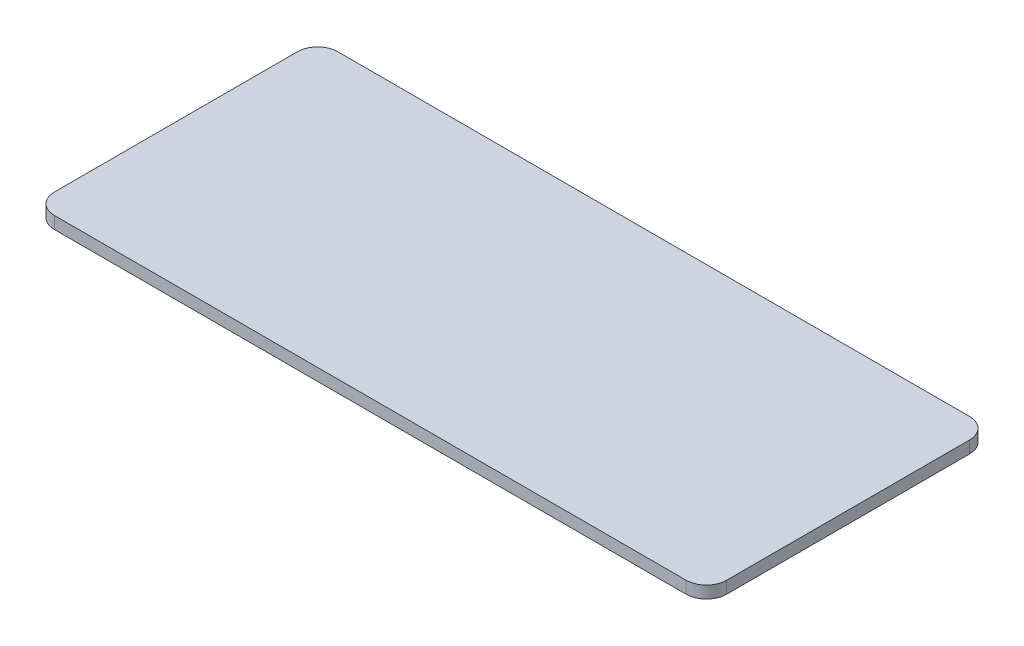
ISO-10303-21;
HEADER;
FILE_DESCRIPTION(('STEP AP214'),'2;1');
FILE_NAME('part.step','',(''),(''),'','','');
FILE_SCHEMA(('AUTOMOTIVE_DESIGN { 1 0 10303 214 1 1 1 1 }'));
ENDSEC;
DATA;
#1=APPLICATION_CONTEXT('core data for automotive mechanical design processes');
#2=APPLICATION_PROTOCOL_DEFINITION('international standard','automotive_design',2000,#1);
#3=PRODUCT_CONTEXT('',#1,'mechanical');
#4=PRODUCT('Part','Part','',(#3));
#5=PRODUCT_RELATED_PRODUCT_CATEGORY('part','',(#4));
#6=PRODUCT_DEFINITION_FORMATION('','',#4);
#7=PRODUCT_DEFINITION_CONTEXT('part definition',#1,'design');
#8=PRODUCT_DEFINITION('design','',#6,#7);
#9=PRODUCT_DEFINITION_SHAPE('','',#8);
#10=(LENGTH_UNIT() NAMED_UNIT(*) SI_UNIT(.MILLI.,.METRE.));
#11=(NAMED_UNIT(*) PLANE_ANGLE_UNIT() SI_UNIT($,.RADIAN.));
#12=(NAMED_UNIT(*) SI_UNIT($,.STERADIAN.) SOLID_ANGLE_UNIT());
#13=UNCERTAINTY_MEASURE_WITH_UNIT(LENGTH_MEASURE(1.E-05),#10,'distance_accuracy_value','');
#14=(GEOMETRIC_REPRESENTATION_CONTEXT(3) GLOBAL_UNCERTAINTY_ASSIGNED_CONTEXT((#13)) GLOBAL_UNIT_ASSIGNED_CONTEXT((#10,
#11,#12)) REPRESENTATION_CONTEXT('',''));
#15=CARTESIAN_POINT('',(0.,0.,0.));
#16=DIRECTION('',(0.,0.,1.));
#17=DIRECTION('',(1.,0.,0.));
#18=AXIS2_PLACEMENT_3D('',#15,#16,#17);
#19=CARTESIAN_POINT('',(0.,47.,0.));
#20=DIRECTION('',(0.,1.,0.));
#21=DIRECTION('',(0.,0.,1.));
#22=AXIS2_PLACEMENT_3D('',#19,#20,#21);
#23=PLANE('',#22);
#24=CARTESIAN_POINT('',(62.6371308016877,47.,-42.8481012658228));
#25=DIRECTION('',(0.,1.,0.));
#26=DIRECTION('',(0.,0.,1.));
#27=AXIS2_PLACEMENT_3D('',#24,#25,#26);
#28=CIRCLE('',#27,5.);
#29=CARTESIAN_POINT('',(62.6371308016877,47.,-47.8481012658228));
#30=VERTEX_POINT('',#29);
#31=CARTESIAN_POINT('',(67.6371308016878,47.,-42.8481012658228));
#32=VERTEX_POINT('',#31);
#33=EDGE_CURVE('E127',#30,#32,#28,.F.);
#34=ORIENTED_EDGE('',*,*,#33,.T.);
#35=DIRECTION('',(0.,0.,-1.));
#36=VECTOR('',#35,1.);
#37=CARTESIAN_POINT('',(67.6371308016878,47.,-47.8481012658228));
#38=LINE('',#37,#36);
#39=CARTESIAN_POINT('',(67.6371308016878,47.,17.1518987341772));
#40=VERTEX_POINT('',#39);
#41=EDGE_CURVE('E130',#40,#32,#38,.T.);
#42=ORIENTED_EDGE('',*,*,#41,.F.);
#43=CARTESIAN_POINT('',(62.6371308016878,47.,17.1518987341772));
#44=DIRECTION('',(0.,1.,0.));
#45=DIRECTION('',(0.,0.,1.));
#46=AXIS2_PLACEMENT_3D('',#43,#44,#45);
#47=CIRCLE('',#46,5.);
#48=CARTESIAN_POINT('',(62.6371308016878,47.,22.1518987341772));
#49=VERTEX_POINT('',#48);
#50=EDGE_CURVE('E115',#40,#49,#47,.F.);
#51=ORIENTED_EDGE('',*,*,#50,.T.);
#52=DIRECTION('',(1.,0.,0.));
#53=VECTOR('',#52,1.);
#54=CARTESIAN_POINT('',(-98.3544303797468,47.,22.1518987341772));
#55=LINE('',#54,#53);
#56=CARTESIAN_POINT('',(-93.3544303797468,47.,22.1518987341772));
#57=VERTEX_POINT('',#56);
#58=EDGE_CURVE('E106',#57,#49,#55,.T.);
#59=ORIENTED_EDGE('',*,*,#58,.F.);
#60=CARTESIAN_POINT('',(-93.3544303797468,47.,17.1518987341772));
#61=DIRECTION('',(0.,1.,0.));
#62=DIRECTION('',(0.,0.,1.));
#63=AXIS2_PLACEMENT_3D('',#60,#61,#62);
#64=CIRCLE('',#63,5.);
#65=CARTESIAN_POINT('',(-98.3544303797468,47.,17.1518987341772));
#66=VERTEX_POINT('',#65);
#67=EDGE_CURVE('E37',#57,#66,#64,.F.);
#68=ORIENTED_EDGE('',*,*,#67,.T.);
#69=DIRECTION('',(0.,0.,1.));
#70=VECTOR('',#69,1.);
#71=CARTESIAN_POINT('',(-98.3544303797468,47.,-47.8481012658228));
#72=LINE('',#71,#70);
#73=CARTESIAN_POINT('',(-98.3544303797468,47.,-42.8481012658228));
#74=VERTEX_POINT('',#73);
#75=EDGE_CURVE('E99',#74,#66,#72,.T.);
#76=ORIENTED_EDGE('',*,*,#75,.F.);
#77=CARTESIAN_POINT('',(-93.3544303797468,47.,-42.8481012658228));
#78=DIRECTION('',(0.,1.,0.));
#79=DIRECTION('',(0.,0.,1.));
#80=AXIS2_PLACEMENT_3D('',#77,#78,#79);
#81=CIRCLE('',#80,5.);
#82=CARTESIAN_POINT('',(-93.3544303797468,47.,-47.8481012658228));
#83=VERTEX_POINT('',#82);
#84=EDGE_CURVE('E107',#74,#83,#81,.F.);
#85=ORIENTED_EDGE('',*,*,#84,.T.);
#86=DIRECTION('',(-1.,0.,0.));
#87=VECTOR('',#86,1.);
#88=CARTESIAN_POINT('',(-98.3544303797468,47.,-47.8481012658228));
#89=LINE('',#88,#87);
#90=EDGE_CURVE('E142',#30,#83,#89,.T.);
#91=ORIENTED_EDGE('',*,*,#90,.F.);
#92=EDGE_LOOP('',(#34,#42,#51,#59,#68,#76,#85,#91));
#93=FACE_BOUND('',#92,.T.);
#94=ADVANCED_FACE('F33',(#93),#23,.F.);
#95=CARTESIAN_POINT('',(-98.3544303797468,50.,-47.8481012658228));
#96=DIRECTION('',(1.,0.,0.));
#97=DIRECTION('',(0.,0.,-1.));
#98=AXIS2_PLACEMENT_3D('',#95,#96,#97);
#99=PLANE('',#98);
#100=DIRECTION('',(0.,-1.,0.));
#101=VECTOR('',#100,1.);
#102=CARTESIAN_POINT('',(-98.3544303797468,50.,-42.8481012658228));
#103=LINE('',#102,#101);
#104=CARTESIAN_POINT('',(-98.3544303797468,50.,-42.8481012658228));
#105=VERTEX_POINT('',#104);
#106=EDGE_CURVE('E103',#105,#74,#103,.T.);
#107=ORIENTED_EDGE('',*,*,#106,.T.);
#108=ORIENTED_EDGE('',*,*,#75,.T.);
#109=DIRECTION('',(0.,-1.,0.));
#110=VECTOR('',#109,1.);
#111=CARTESIAN_POINT('',(-98.3544303797468,50.,17.1518987341772));
#112=LINE('',#111,#110);
#113=CARTESIAN_POINT('',(-98.3544303797468,50.,17.1518987341772));
#114=VERTEX_POINT('',#113);
#115=EDGE_CURVE('E56',#66,#114,#112,.F.);
#116=ORIENTED_EDGE('',*,*,#115,.T.);
#117=DIRECTION('',(0.,0.,1.));
#118=VECTOR('',#117,1.);
#119=CARTESIAN_POINT('',(-98.3544303797468,50.,-47.8481012658228));
#120=LINE('',#119,#118);
#121=EDGE_CURVE('E11',#105,#114,#120,.T.);
#122=ORIENTED_EDGE('',*,*,#121,.F.);
#123=EDGE_LOOP('',(#107,#108,#116,#122));
#124=FACE_BOUND('',#123,.T.);
#125=ADVANCED_FACE('F101',(#124),#99,.F.);
#126=CARTESIAN_POINT('',(-98.3544303797468,50.,22.1518987341772));
#127=DIRECTION('',(0.,0.,-1.));
#128=DIRECTION('',(-1.,0.,0.));
#129=AXIS2_PLACEMENT_3D('',#126,#127,#128);
#130=PLANE('',#129);
#131=DIRECTION('',(0.,-1.,0.));
#132=VECTOR('',#131,1.);
#133=CARTESIAN_POINT('',(-93.3544303797468,50.,22.1518987341772));
#134=LINE('',#133,#132);
#135=CARTESIAN_POINT('',(-93.3544303797468,50.,22.1518987341772));
#136=VERTEX_POINT('',#135);
#137=EDGE_CURVE('E141',#136,#57,#134,.T.);
#138=ORIENTED_EDGE('',*,*,#137,.T.);
#139=ORIENTED_EDGE('',*,*,#58,.T.);
#140=DIRECTION('',(0.,-1.,0.));
#141=VECTOR('',#140,1.);
#142=CARTESIAN_POINT('',(62.6371308016878,50.,22.1518987341772));
#143=LINE('',#142,#141);
#144=CARTESIAN_POINT('',(62.6371308016878,50.,22.1518987341772));
#145=VERTEX_POINT('',#144);
#146=EDGE_CURVE('E135',#49,#145,#143,.F.);
#147=ORIENTED_EDGE('',*,*,#146,.T.);
#148=DIRECTION('',(1.,0.,0.));
#149=VECTOR('',#148,1.);
#150=CARTESIAN_POINT('',(-98.3544303797468,50.,22.1518987341772));
#151=LINE('',#150,#149);
#152=EDGE_CURVE('E42',#136,#145,#151,.T.);
#153=ORIENTED_EDGE('',*,*,#152,.F.);
#154=EDGE_LOOP('',(#138,#139,#147,#153));
#155=FACE_BOUND('',#154,.T.);
#156=ADVANCED_FACE('F176',(#155),#130,.F.);
#157=CARTESIAN_POINT('',(67.6371308016878,50.,-47.8481012658228));
#158=DIRECTION('',(-1.,0.,0.));
#159=DIRECTION('',(0.,0.,1.));
#160=AXIS2_PLACEMENT_3D('',#157,#158,#159);
#161=PLANE('',#160);
#162=DIRECTION('',(0.,-1.,0.));
#163=VECTOR('',#162,1.);
#164=CARTESIAN_POINT('',(67.6371308016878,50.,17.1518987341772));
#165=LINE('',#164,#163);
#166=CARTESIAN_POINT('',(67.6371308016878,50.,17.1518987341772));
#167=VERTEX_POINT('',#166);
#168=EDGE_CURVE('E150',#167,#40,#165,.T.);
#169=ORIENTED_EDGE('',*,*,#168,.T.);
#170=ORIENTED_EDGE('',*,*,#41,.T.);
#171=DIRECTION('',(0.,-1.,0.));
#172=VECTOR('',#171,1.);
#173=CARTESIAN_POINT('',(67.6371308016878,50.,-42.8481012658228));
#174=LINE('',#173,#172);
#175=CARTESIAN_POINT('',(67.6371308016878,50.,-42.8481012658228));
#176=VERTEX_POINT('',#175);
#177=EDGE_CURVE('E144',#32,#176,#174,.F.);
#178=ORIENTED_EDGE('',*,*,#177,.T.);
#179=DIRECTION('',(0.,0.,-1.));
#180=VECTOR('',#179,1.);
#181=CARTESIAN_POINT('',(67.6371308016878,50.,-47.8481012658228));
#182=LINE('',#181,#180);
#183=EDGE_CURVE('E120',#167,#176,#182,.T.);
#184=ORIENTED_EDGE('',*,*,#183,.F.);
#185=EDGE_LOOP('',(#169,#170,#178,#184));
#186=FACE_BOUND('',#185,.T.);
#187=ADVANCED_FACE('F179',(#186),#161,.F.);
#188=CARTESIAN_POINT('',(-98.3544303797468,50.,-47.8481012658228));
#189=DIRECTION('',(0.,0.,1.));
#190=DIRECTION('',(1.,0.,0.));
#191=AXIS2_PLACEMENT_3D('',#188,#189,#190);
#192=PLANE('',#191);
#193=DIRECTION('',(0.,-1.,0.));
#194=VECTOR('',#193,1.);
#195=CARTESIAN_POINT('',(62.6371308016877,50.,-47.8481012658228));
#196=LINE('',#195,#194);
#197=CARTESIAN_POINT('',(62.6371308016877,50.,-47.8481012658228));
#198=VERTEX_POINT('',#197);
#199=EDGE_CURVE('E122',#198,#30,#196,.T.);
#200=ORIENTED_EDGE('',*,*,#199,.T.);
#201=ORIENTED_EDGE('',*,*,#90,.T.);
#202=DIRECTION('',(0.,-1.,0.));
#203=VECTOR('',#202,1.);
#204=CARTESIAN_POINT('',(-93.3544303797468,50.,-47.8481012658228));
#205=LINE('',#204,#203);
#206=CARTESIAN_POINT('',(-93.3544303797468,50.,-47.8481012658228));
#207=VERTEX_POINT('',#206);
#208=EDGE_CURVE('E152',#83,#207,#205,.F.);
#209=ORIENTED_EDGE('',*,*,#208,.T.);
#210=DIRECTION('',(-1.,0.,0.));
#211=VECTOR('',#210,1.);
#212=CARTESIAN_POINT('',(-98.3544303797468,50.,-47.8481012658228));
#213=LINE('',#212,#211);
#214=EDGE_CURVE('E118',#198,#207,#213,.T.);
#215=ORIENTED_EDGE('',*,*,#214,.F.);
#216=EDGE_LOOP('',(#200,#201,#209,#215));
#217=FACE_BOUND('',#216,.T.);
#218=ADVANCED_FACE('F157',(#217),#192,.F.);
#219=CARTESIAN_POINT('',(-93.3544303797468,50.,-42.8481012658228));
#220=DIRECTION('',(0.,-1.,0.));
#221=DIRECTION('',(0.,0.,-1.));
#222=AXIS2_PLACEMENT_3D('',#219,#220,#221);
#223=CYLINDRICAL_SURFACE('',#222,5.);
#224=ORIENTED_EDGE('',*,*,#84,.F.);
#225=ORIENTED_EDGE('',*,*,#106,.F.);
#226=CARTESIAN_POINT('',(-93.3544303797468,50.,-42.8481012658228));
#227=DIRECTION('',(0.,1.,0.));
#228=DIRECTION('',(0.,0.,1.));
#229=AXIS2_PLACEMENT_3D('',#226,#227,#228);
#230=CIRCLE('',#229,5.);
#231=EDGE_CURVE('E49',#207,#105,#230,.T.);
#232=ORIENTED_EDGE('',*,*,#231,.F.);
#233=ORIENTED_EDGE('',*,*,#208,.F.);
#234=EDGE_LOOP('',(#224,#225,#232,#233));
#235=FACE_BOUND('',#234,.T.);
#236=ADVANCED_FACE('F166',(#235),#223,.T.);
#237=CARTESIAN_POINT('',(62.6371308016877,50.,-42.8481012658228));
#238=DIRECTION('',(0.,-1.,0.));
#239=DIRECTION('',(0.,0.,-1.));
#240=AXIS2_PLACEMENT_3D('',#237,#238,#239);
#241=CYLINDRICAL_SURFACE('',#240,5.);
#242=ORIENTED_EDGE('',*,*,#33,.F.);
#243=ORIENTED_EDGE('',*,*,#199,.F.);
#244=CARTESIAN_POINT('',(62.6371308016877,50.,-42.8481012658228));
#245=DIRECTION('',(0.,1.,0.));
#246=DIRECTION('',(0.,0.,1.));
#247=AXIS2_PLACEMENT_3D('',#244,#245,#246);
#248=CIRCLE('',#247,5.);
#249=EDGE_CURVE('E163',#176,#198,#248,.T.);
#250=ORIENTED_EDGE('',*,*,#249,.F.);
#251=ORIENTED_EDGE('',*,*,#177,.F.);
#252=EDGE_LOOP('',(#242,#243,#250,#251));
#253=FACE_BOUND('',#252,.T.);
#254=ADVANCED_FACE('F161',(#253),#241,.T.);
#255=CARTESIAN_POINT('',(62.6371308016878,50.,17.1518987341772));
#256=DIRECTION('',(0.,-1.,0.));
#257=DIRECTION('',(0.,0.,-1.));
#258=AXIS2_PLACEMENT_3D('',#255,#256,#257);
#259=CYLINDRICAL_SURFACE('',#258,5.);
#260=ORIENTED_EDGE('',*,*,#50,.F.);
#261=ORIENTED_EDGE('',*,*,#168,.F.);
#262=CARTESIAN_POINT('',(62.6371308016878,50.,17.1518987341772));
#263=DIRECTION('',(0.,1.,0.));
#264=DIRECTION('',(0.,0.,1.));
#265=AXIS2_PLACEMENT_3D('',#262,#263,#264);
#266=CIRCLE('',#265,5.);
#267=EDGE_CURVE('E137',#145,#167,#266,.T.);
#268=ORIENTED_EDGE('',*,*,#267,.F.);
#269=ORIENTED_EDGE('',*,*,#146,.F.);
#270=EDGE_LOOP('',(#260,#261,#268,#269));
#271=FACE_BOUND('',#270,.T.);
#272=ADVANCED_FACE('F136',(#271),#259,.T.);
#273=CARTESIAN_POINT('',(-93.3544303797468,50.,17.1518987341772));
#274=DIRECTION('',(0.,-1.,0.));
#275=DIRECTION('',(0.,0.,-1.));
#276=AXIS2_PLACEMENT_3D('',#273,#274,#275);
#277=CYLINDRICAL_SURFACE('',#276,5.);
#278=ORIENTED_EDGE('',*,*,#67,.F.);
#279=ORIENTED_EDGE('',*,*,#137,.F.);
#280=CARTESIAN_POINT('',(-93.3544303797468,50.,17.1518987341772));
#281=DIRECTION('',(0.,1.,0.));
#282=DIRECTION('',(0.,0.,1.));
#283=AXIS2_PLACEMENT_3D('',#280,#281,#282);
#284=CIRCLE('',#283,5.);
#285=EDGE_CURVE('E117',#114,#136,#284,.T.);
#286=ORIENTED_EDGE('',*,*,#285,.F.);
#287=ORIENTED_EDGE('',*,*,#115,.F.);
#288=EDGE_LOOP('',(#278,#279,#286,#287));
#289=FACE_BOUND('',#288,.T.);
#290=ADVANCED_FACE('F35',(#289),#277,.T.);
#291=CARTESIAN_POINT('',(0.,50.,0.));
#292=DIRECTION('',(0.,1.,0.));
#293=DIRECTION('',(0.,0.,1.));
#294=AXIS2_PLACEMENT_3D('',#291,#292,#293);
#295=PLANE('',#294);
#296=ORIENTED_EDGE('',*,*,#214,.T.);
#297=ORIENTED_EDGE('',*,*,#231,.T.);
#298=ORIENTED_EDGE('',*,*,#121,.T.);
#299=ORIENTED_EDGE('',*,*,#285,.T.);
#300=ORIENTED_EDGE('',*,*,#152,.T.);
#301=ORIENTED_EDGE('',*,*,#267,.T.);
#302=ORIENTED_EDGE('',*,*,#183,.T.);
#303=ORIENTED_EDGE('',*,*,#249,.T.);
#304=EDGE_LOOP('',(#296,#297,#298,#299,#300,#301,#302,#303));
#305=FACE_BOUND('',#304,.T.);
#306=ADVANCED_FACE('F167',(#305),#295,.T.);
#307=CLOSED_SHELL('',(#94,#125,#156,#187,#218,#236,#254,#272,#290,#306));
#308=MANIFOLD_SOLID_BREP('B2',#307);
#309=ADVANCED_BREP_SHAPE_REPRESENTATION('',(#18,#308),#14);
#310=SHAPE_DEFINITION_REPRESENTATION(#9,#309);
ENDSEC;
END-ISO-10303-21;
